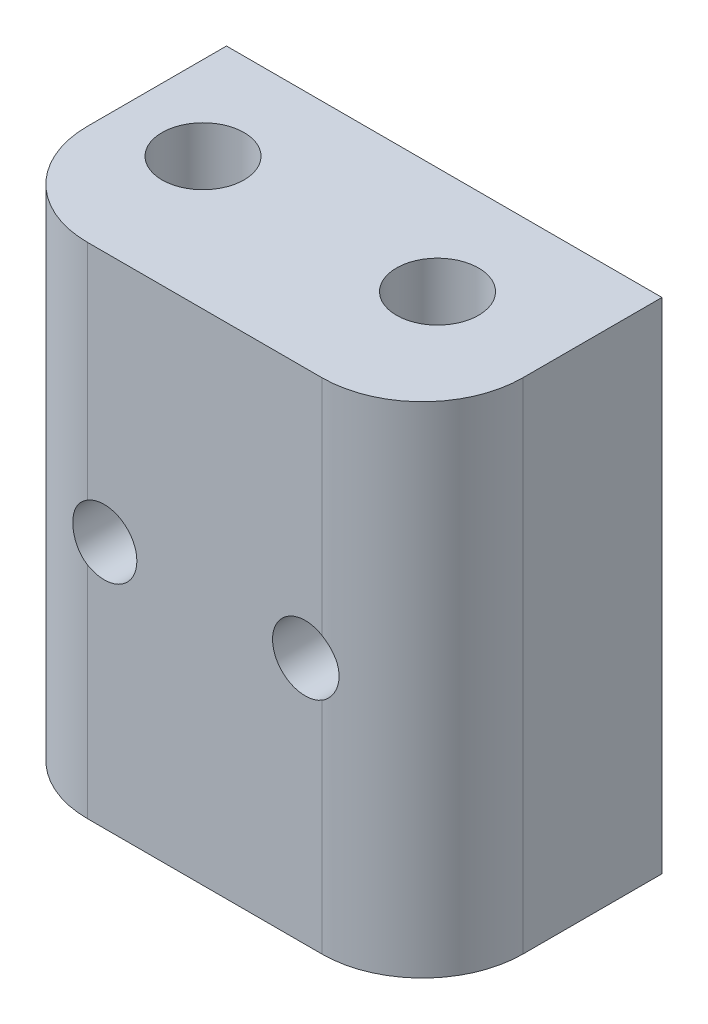
ISO-10303-21;
HEADER;
FILE_DESCRIPTION(('STEP AP214'),'2;1');
FILE_NAME('part.step','',(''),(''),'','','');
FILE_SCHEMA(('AUTOMOTIVE_DESIGN { 1 0 10303 214 1 1 1 1 }'));
ENDSEC;
DATA;
#1=APPLICATION_CONTEXT('core data for automotive mechanical design processes');
#2=APPLICATION_PROTOCOL_DEFINITION('international standard','automotive_design',2000,#1);
#3=PRODUCT_CONTEXT('',#1,'mechanical');
#4=PRODUCT('Part','Part','',(#3));
#5=PRODUCT_RELATED_PRODUCT_CATEGORY('part','',(#4));
#6=PRODUCT_DEFINITION_FORMATION('','',#4);
#7=PRODUCT_DEFINITION_CONTEXT('part definition',#1,'design');
#8=PRODUCT_DEFINITION('design','',#6,#7);
#9=PRODUCT_DEFINITION_SHAPE('','',#8);
#10=(LENGTH_UNIT() NAMED_UNIT(*) SI_UNIT(.MILLI.,.METRE.));
#11=(NAMED_UNIT(*) PLANE_ANGLE_UNIT() SI_UNIT($,.RADIAN.));
#12=(NAMED_UNIT(*) SI_UNIT($,.STERADIAN.) SOLID_ANGLE_UNIT());
#13=UNCERTAINTY_MEASURE_WITH_UNIT(LENGTH_MEASURE(1.E-05),#10,'distance_accuracy_value','');
#14=(GEOMETRIC_REPRESENTATION_CONTEXT(3) GLOBAL_UNCERTAINTY_ASSIGNED_CONTEXT((#13)) GLOBAL_UNIT_ASSIGNED_CONTEXT((#10,
#11,#12)) REPRESENTATION_CONTEXT('',''));
#15=CARTESIAN_POINT('',(0.,0.,0.));
#16=DIRECTION('',(0.,0.,1.));
#17=DIRECTION('',(1.,0.,0.));
#18=AXIS2_PLACEMENT_3D('',#15,#16,#17);
#19=CARTESIAN_POINT('',(13.1453049350976,13.6204306214154,14.3));
#20=DIRECTION('',(-1.,0.,0.));
#21=DIRECTION('',(0.,1.,0.));
#22=AXIS2_PLACEMENT_3D('',#19,#20,#21);
#23=PLANE('',#22);
#24=DIRECTION('',(0.,0.,-1.));
#25=VECTOR('',#24,1.);
#26=CARTESIAN_POINT('',(13.1453049350976,-16.1795693785846,14.3));
#27=LINE('',#26,#25);
#28=CARTESIAN_POINT('',(13.1453049350976,-16.1795693785846,8.3));
#29=VERTEX_POINT('',#28);
#30=CARTESIAN_POINT('',(13.1453049350976,-16.1795693785846,0.));
#31=VERTEX_POINT('',#30);
#32=EDGE_CURVE('E115',#29,#31,#27,.T.);
#33=ORIENTED_EDGE('',*,*,#32,.T.);
#34=DIRECTION('',(0.,-1.,0.));
#35=VECTOR('',#34,1.);
#36=CARTESIAN_POINT('',(13.1453049350976,13.6204306214154,0.));
#37=LINE('',#36,#35);
#38=CARTESIAN_POINT('',(13.1453049350976,13.6204306214154,0.));
#39=VERTEX_POINT('',#38);
#40=EDGE_CURVE('E214',#39,#31,#37,.T.);
#41=ORIENTED_EDGE('',*,*,#40,.F.);
#42=DIRECTION('',(0.,0.,-1.));
#43=VECTOR('',#42,1.);
#44=CARTESIAN_POINT('',(13.1453049350976,13.6204306214154,14.3));
#45=LINE('',#44,#43);
#46=CARTESIAN_POINT('',(13.1453049350976,13.6204306214154,8.3));
#47=VERTEX_POINT('',#46);
#48=EDGE_CURVE('E223',#47,#39,#45,.T.);
#49=ORIENTED_EDGE('',*,*,#48,.F.);
#50=DIRECTION('',(0.,-1.,0.));
#51=VECTOR('',#50,1.);
#52=CARTESIAN_POINT('',(13.1453049350976,13.6204306214154,8.3));
#53=LINE('',#52,#51);
#54=EDGE_CURVE('E250',#29,#47,#53,.F.);
#55=ORIENTED_EDGE('',*,*,#54,.F.);
#56=EDGE_LOOP('',(#33,#41,#49,#55));
#57=FACE_BOUND('',#56,.T.);
#58=ADVANCED_FACE('F32',(#57),#23,.F.);
#59=CARTESIAN_POINT('',(13.1453049350976,-16.1795693785846,14.3));
#60=DIRECTION('',(0.,1.,0.));
#61=DIRECTION('',(0.,0.,1.));
#62=AXIS2_PLACEMENT_3D('',#59,#60,#61);
#63=PLANE('',#62);
#64=CARTESIAN_POINT('',(6.14530493509756,-16.1795693785846,6.4));
#65=DIRECTION('',(0.,-1.,0.));
#66=DIRECTION('',(0.,0.,1.));
#67=AXIS2_PLACEMENT_3D('',#64,#65,#66);
#68=CIRCLE('',#67,2.45);
#69=CARTESIAN_POINT('',(6.14530493509756,-16.1795693785846,8.85));
#70=VERTEX_POINT('',#69);
#71=EDGE_CURVE('E166',#70,#70,#68,.T.);
#72=ORIENTED_EDGE('',*,*,#71,.F.);
#73=EDGE_LOOP('',(#72));
#74=FACE_BOUND('',#73,.T.);
#75=CARTESIAN_POINT('',(-7.85469506492416,-16.1795693785846,6.40000020034491));
#76=DIRECTION('',(0.,-1.,0.));
#77=DIRECTION('',(0.,0.,1.));
#78=AXIS2_PLACEMENT_3D('',#75,#76,#77);
#79=CIRCLE('',#78,2.45);
#80=CARTESIAN_POINT('',(-7.85469506492416,-16.1795693785846,8.85000020034491));
#81=VERTEX_POINT('',#80);
#82=EDGE_CURVE('E208',#81,#81,#79,.T.);
#83=ORIENTED_EDGE('',*,*,#82,.F.);
#84=EDGE_LOOP('',(#83));
#85=FACE_BOUND('',#84,.T.);
#86=DIRECTION('',(-1.,0.,0.));
#87=VECTOR('',#86,1.);
#88=CARTESIAN_POINT('',(13.1453049350976,-16.1795693785846,14.3));
#89=LINE('',#88,#87);
#90=CARTESIAN_POINT('',(7.14530493509755,-16.1795693785846,14.3));
#91=VERTEX_POINT('',#90);
#92=CARTESIAN_POINT('',(-6.85469506490244,-16.1795693785846,14.3));
#93=VERTEX_POINT('',#92);
#94=EDGE_CURVE('E218',#91,#93,#89,.T.);
#95=ORIENTED_EDGE('',*,*,#94,.T.);
#96=CARTESIAN_POINT('',(-6.85469506490245,-16.1795693785846,8.3));
#97=DIRECTION('',(0.,-1.,0.));
#98=DIRECTION('',(0.,0.,1.));
#99=AXIS2_PLACEMENT_3D('',#96,#97,#98);
#100=CIRCLE('',#99,6.);
#101=CARTESIAN_POINT('',(-12.8546950649024,-16.1795693785846,8.3));
#102=VERTEX_POINT('',#101);
#103=EDGE_CURVE('E246',#102,#93,#100,.F.);
#104=ORIENTED_EDGE('',*,*,#103,.F.);
#105=DIRECTION('',(0.,0.,-1.));
#106=VECTOR('',#105,1.);
#107=CARTESIAN_POINT('',(-12.8546950649024,-16.1795693785846,14.3));
#108=LINE('',#107,#106);
#109=CARTESIAN_POINT('',(-12.8546950649024,-16.1795693785846,0.));
#110=VERTEX_POINT('',#109);
#111=EDGE_CURVE('E238',#102,#110,#108,.T.);
#112=ORIENTED_EDGE('',*,*,#111,.T.);
#113=DIRECTION('',(-1.,0.,0.));
#114=VECTOR('',#113,1.);
#115=CARTESIAN_POINT('',(13.1453049350976,-16.1795693785846,0.));
#116=LINE('',#115,#114);
#117=EDGE_CURVE('E226',#31,#110,#116,.T.);
#118=ORIENTED_EDGE('',*,*,#117,.F.);
#119=ORIENTED_EDGE('',*,*,#32,.F.);
#120=CARTESIAN_POINT('',(7.14530493509755,-16.1795693785846,8.3));
#121=DIRECTION('',(0.,-1.,0.));
#122=DIRECTION('',(0.,0.,1.));
#123=AXIS2_PLACEMENT_3D('',#120,#121,#122);
#124=CIRCLE('',#123,6.);
#125=EDGE_CURVE('E248',#91,#29,#124,.F.);
#126=ORIENTED_EDGE('',*,*,#125,.F.);
#127=EDGE_LOOP('',(#95,#104,#112,#118,#119,#126));
#128=FACE_BOUND('',#127,.T.);
#129=ADVANCED_FACE('F176',(#74,#85,#128),#63,.F.);
#130=CARTESIAN_POINT('',(-12.8546950649024,13.6204306214154,14.3));
#131=DIRECTION('',(1.,0.,0.));
#132=DIRECTION('',(0.,-1.,0.));
#133=AXIS2_PLACEMENT_3D('',#130,#131,#132);
#134=PLANE('',#133);
#135=DIRECTION('',(0.,0.,-1.));
#136=VECTOR('',#135,1.);
#137=CARTESIAN_POINT('',(-12.8546950649024,13.6204306214154,14.3));
#138=LINE('',#137,#136);
#139=CARTESIAN_POINT('',(-12.8546950649024,13.6204306214154,8.3));
#140=VERTEX_POINT('',#139);
#141=CARTESIAN_POINT('',(-12.8546950649024,13.6204306214154,0.));
#142=VERTEX_POINT('',#141);
#143=EDGE_CURVE('E235',#140,#142,#138,.T.);
#144=ORIENTED_EDGE('',*,*,#143,.T.);
#145=DIRECTION('',(0.,1.,0.));
#146=VECTOR('',#145,1.);
#147=CARTESIAN_POINT('',(-12.8546950649024,13.6204306214154,0.));
#148=LINE('',#147,#146);
#149=EDGE_CURVE('E229',#110,#142,#148,.T.);
#150=ORIENTED_EDGE('',*,*,#149,.F.);
#151=ORIENTED_EDGE('',*,*,#111,.F.);
#152=DIRECTION('',(0.,1.,0.));
#153=VECTOR('',#152,1.);
#154=CARTESIAN_POINT('',(-12.8546950649024,-16.1795693785846,8.3));
#155=LINE('',#154,#153);
#156=EDGE_CURVE('E11',#140,#102,#155,.F.);
#157=ORIENTED_EDGE('',*,*,#156,.F.);
#158=EDGE_LOOP('',(#144,#150,#151,#157));
#159=FACE_BOUND('',#158,.T.);
#160=ADVANCED_FACE('F180',(#159),#134,.F.);
#161=CARTESIAN_POINT('',(13.1453049350976,13.6204306214154,14.3));
#162=DIRECTION('',(0.,-1.,0.));
#163=DIRECTION('',(0.,0.,-1.));
#164=AXIS2_PLACEMENT_3D('',#161,#162,#163);
#165=PLANE('',#164);
#166=CARTESIAN_POINT('',(6.14530493509756,13.6204306214154,6.4));
#167=DIRECTION('',(0.,-1.,0.));
#168=DIRECTION('',(0.,0.,1.));
#169=AXIS2_PLACEMENT_3D('',#166,#167,#168);
#170=CIRCLE('',#169,2.45);
#171=CARTESIAN_POINT('',(6.14530493509756,13.6204306214154,8.85));
#172=VERTEX_POINT('',#171);
#173=EDGE_CURVE('E153',#172,#172,#170,.T.);
#174=ORIENTED_EDGE('',*,*,#173,.T.);
#175=EDGE_LOOP('',(#174));
#176=FACE_BOUND('',#175,.T.);
#177=CARTESIAN_POINT('',(-7.85469506492416,13.6204306214154,6.40000020034491));
#178=DIRECTION('',(0.,-1.,0.));
#179=DIRECTION('',(0.,0.,1.));
#180=AXIS2_PLACEMENT_3D('',#177,#178,#179);
#181=CIRCLE('',#180,2.45);
#182=CARTESIAN_POINT('',(-7.85469506492416,13.6204306214154,8.85000020034491));
#183=VERTEX_POINT('',#182);
#184=EDGE_CURVE('E211',#183,#183,#181,.T.);
#185=ORIENTED_EDGE('',*,*,#184,.T.);
#186=EDGE_LOOP('',(#185));
#187=FACE_BOUND('',#186,.T.);
#188=ORIENTED_EDGE('',*,*,#48,.T.);
#189=DIRECTION('',(1.,0.,0.));
#190=VECTOR('',#189,1.);
#191=CARTESIAN_POINT('',(13.1453049350976,13.6204306214154,0.));
#192=LINE('',#191,#190);
#193=EDGE_CURVE('E221',#142,#39,#192,.T.);
#194=ORIENTED_EDGE('',*,*,#193,.F.);
#195=ORIENTED_EDGE('',*,*,#143,.F.);
#196=CARTESIAN_POINT('',(-6.85469506490245,13.6204306214154,8.3));
#197=DIRECTION('',(0.,1.,0.));
#198=DIRECTION('',(0.,0.,-1.));
#199=AXIS2_PLACEMENT_3D('',#196,#197,#198);
#200=CIRCLE('',#199,6.);
#201=CARTESIAN_POINT('',(-6.85469506490244,13.6204306214154,14.3));
#202=VERTEX_POINT('',#201);
#203=EDGE_CURVE('E253',#202,#140,#200,.F.);
#204=ORIENTED_EDGE('',*,*,#203,.F.);
#205=DIRECTION('',(1.,0.,0.));
#206=VECTOR('',#205,1.);
#207=CARTESIAN_POINT('',(13.1453049350976,13.6204306214154,14.3));
#208=LINE('',#207,#206);
#209=CARTESIAN_POINT('',(7.14530493509756,13.6204306214154,14.3));
#210=VERTEX_POINT('',#209);
#211=EDGE_CURVE('E113',#202,#210,#208,.T.);
#212=ORIENTED_EDGE('',*,*,#211,.T.);
#213=CARTESIAN_POINT('',(7.14530493509756,13.6204306214154,8.3));
#214=DIRECTION('',(0.,1.,0.));
#215=DIRECTION('',(0.,0.,-1.));
#216=AXIS2_PLACEMENT_3D('',#213,#214,#215);
#217=CIRCLE('',#216,6.);
#218=EDGE_CURVE('E46',#47,#210,#217,.F.);
#219=ORIENTED_EDGE('',*,*,#218,.F.);
#220=EDGE_LOOP('',(#188,#194,#195,#204,#212,#219));
#221=FACE_BOUND('',#220,.T.);
#222=ADVANCED_FACE('F184',(#176,#187,#221),#165,.F.);
#223=CARTESIAN_POINT('',(13.1453049350976,-16.1795693785846,14.3));
#224=DIRECTION('',(0.,0.,1.));
#225=DIRECTION('',(-1.,0.,0.));
#226=AXIS2_PLACEMENT_3D('',#223,#224,#225);
#227=PLANE('',#226);
#228=CARTESIAN_POINT('',(-5.85469506490245,-1.37956937858462,14.3));
#229=DIRECTION('',(0.,0.,-1.));
#230=DIRECTION('',(-1.,0.,0.));
#231=AXIS2_PLACEMENT_3D('',#228,#229,#230);
#232=CIRCLE('',#231,1.95);
#233=CARTESIAN_POINT('',(-6.85469506490245,0.294497525693705,14.3));
#234=VERTEX_POINT('',#233);
#235=CARTESIAN_POINT('',(-6.85469506490245,-3.05363628286294,14.3));
#236=VERTEX_POINT('',#235);
#237=EDGE_CURVE('E111',#234,#236,#232,.T.);
#238=ORIENTED_EDGE('',*,*,#237,.T.);
#239=DIRECTION('',(0.,1.,0.));
#240=VECTOR('',#239,1.);
#241=CARTESIAN_POINT('',(-6.85469506490245,13.6204306214154,14.3));
#242=LINE('',#241,#240);
#243=EDGE_CURVE('E105',#93,#236,#242,.T.);
#244=ORIENTED_EDGE('',*,*,#243,.F.);
#245=ORIENTED_EDGE('',*,*,#94,.F.);
#246=DIRECTION('',(0.,-1.,0.));
#247=VECTOR('',#246,1.);
#248=CARTESIAN_POINT('',(7.14530493509755,-16.1795693785846,14.3));
#249=LINE('',#248,#247);
#250=CARTESIAN_POINT('',(7.14530493509755,-3.05363628286294,14.3));
#251=VERTEX_POINT('',#250);
#252=EDGE_CURVE('E243',#251,#91,#249,.T.);
#253=ORIENTED_EDGE('',*,*,#252,.F.);
#254=CARTESIAN_POINT('',(6.14530493509755,-1.37956937858462,14.3));
#255=DIRECTION('',(0.,0.,-1.));
#256=DIRECTION('',(-1.,0.,0.));
#257=AXIS2_PLACEMENT_3D('',#254,#255,#256);
#258=CIRCLE('',#257,1.95);
#259=CARTESIAN_POINT('',(7.14530493509755,0.294497525693705,14.3));
#260=VERTEX_POINT('',#259);
#261=EDGE_CURVE('E107',#251,#260,#258,.T.);
#262=ORIENTED_EDGE('',*,*,#261,.T.);
#263=EDGE_CURVE('E244',#210,#260,#249,.T.);
#264=ORIENTED_EDGE('',*,*,#263,.F.);
#265=ORIENTED_EDGE('',*,*,#211,.F.);
#266=EDGE_CURVE('E102',#234,#202,#242,.T.);
#267=ORIENTED_EDGE('',*,*,#266,.F.);
#268=EDGE_LOOP('',(#238,#244,#245,#253,#262,#264,#265,#267));
#269=FACE_BOUND('',#268,.T.);
#270=ADVANCED_FACE('F110',(#269),#227,.T.);
#271=CARTESIAN_POINT('',(13.1453049350976,-16.1795693785846,0.));
#272=DIRECTION('',(0.,0.,1.));
#273=DIRECTION('',(-1.,0.,0.));
#274=AXIS2_PLACEMENT_3D('',#271,#272,#273);
#275=PLANE('',#274);
#276=CARTESIAN_POINT('',(-5.85469506490245,-1.37956937858462,0.));
#277=DIRECTION('',(0.,0.,-1.));
#278=DIRECTION('',(-1.,0.,0.));
#279=AXIS2_PLACEMENT_3D('',#276,#277,#278);
#280=CIRCLE('',#279,1.95);
#281=CARTESIAN_POINT('',(-7.80469506490245,-1.37956937858462,0.));
#282=VERTEX_POINT('',#281);
#283=EDGE_CURVE('E119',#282,#282,#280,.T.);
#284=ORIENTED_EDGE('',*,*,#283,.F.);
#285=EDGE_LOOP('',(#284));
#286=FACE_BOUND('',#285,.T.);
#287=CARTESIAN_POINT('',(6.14530493509755,-1.37956937858462,0.));
#288=DIRECTION('',(0.,0.,-1.));
#289=DIRECTION('',(-1.,0.,0.));
#290=AXIS2_PLACEMENT_3D('',#287,#288,#289);
#291=CIRCLE('',#290,1.95);
#292=CARTESIAN_POINT('',(4.19530493509755,-1.37956937858462,0.));
#293=VERTEX_POINT('',#292);
#294=EDGE_CURVE('E127',#293,#293,#291,.T.);
#295=ORIENTED_EDGE('',*,*,#294,.F.);
#296=EDGE_LOOP('',(#295));
#297=FACE_BOUND('',#296,.T.);
#298=ORIENTED_EDGE('',*,*,#40,.T.);
#299=ORIENTED_EDGE('',*,*,#117,.T.);
#300=ORIENTED_EDGE('',*,*,#149,.T.);
#301=ORIENTED_EDGE('',*,*,#193,.T.);
#302=EDGE_LOOP('',(#298,#299,#300,#301));
#303=FACE_BOUND('',#302,.T.);
#304=ADVANCED_FACE('F172',(#286,#297,#303),#275,.F.);
#305=CARTESIAN_POINT('',(7.14530493509755,-16.1795693785846,8.3));
#306=DIRECTION('',(0.,1.,0.));
#307=DIRECTION('',(1.,0.,0.));
#308=AXIS2_PLACEMENT_3D('',#305,#306,#307);
#309=CYLINDRICAL_SURFACE('',#308,6.);
#310=CARTESIAN_POINT('',(7.14530493509755,0.294497525693705,14.3));
#311=CARTESIAN_POINT('',(7.1921696200533,0.266503410643053,14.3000018072945));
#312=CARTESIAN_POINT('',(7.23783240159849,0.236554786161152,14.2994506606315));
#313=CARTESIAN_POINT('',(7.32646750732688,0.172955002499119,14.2974278403165));
#314=CARTESIAN_POINT('',(7.36944036393878,0.13930457969142,14.2959563494702));
#315=CARTESIAN_POINT('',(7.49375747901827,0.0332322869272666,14.2904462090898));
#316=CARTESIAN_POINT('',(7.57068769072364,-0.0444228691703343,14.2853104289395));
#317=CARTESIAN_POINT('',(7.71043908720387,-0.211356420944899,14.2737395438166));
#318=CARTESIAN_POINT('',(7.77326158036889,-0.300633737535304,14.2673045594413));
#319=CARTESIAN_POINT('',(7.88317621599532,-0.488428277006108,14.2547134776081));
#320=CARTESIAN_POINT('',(7.93026878522521,-0.586945249112567,14.248557372588));
#321=CARTESIAN_POINT('',(8.00774141398552,-0.791443063271864,14.237824436147));
#322=CARTESIAN_POINT('',(8.03796859196359,-0.897482663576686,14.2332621873414));
#323=CARTESIAN_POINT('',(8.080153387135,-1.11322369441396,14.2267630866548));
#324=CARTESIAN_POINT('',(8.09211071287886,-1.22292518333409,14.2248262766561));
#325=CARTESIAN_POINT('',(8.09735201427701,-1.44162115449943,14.223986230863));
#326=CARTESIAN_POINT('',(8.09083198083293,-1.55061085783406,14.2250511547799));
#327=CARTESIAN_POINT('',(8.05974312194822,-1.76590425634346,14.2299279398784));
#328=CARTESIAN_POINT('',(8.03517648909521,-1.87220827619492,14.2337394673579));
#329=CARTESIAN_POINT('',(7.96881384183982,-2.07890598764608,14.24331098493));
#330=CARTESIAN_POINT('',(7.92705981276687,-2.17931340519351,14.2490662208279));
#331=CARTESIAN_POINT('',(7.82746326327631,-2.37183687656617,14.2613056503569));
#332=CARTESIAN_POINT('',(7.76961042411703,-2.46394756220229,14.2677903099281));
#333=CARTESIAN_POINT('',(7.63855494668526,-2.63844745818186,14.2800576282276));
#334=CARTESIAN_POINT('',(7.56516269146031,-2.7206948567819,14.2858300746759));
#335=CARTESIAN_POINT('',(7.40561601259518,-2.87158618932355,14.2948781931312));
#336=CARTESIAN_POINT('',(7.31949255469582,-2.94026221100645,14.2981598079173));
#337=CARTESIAN_POINT('',(7.20108121598344,-3.01936277001372,14.2998038733818));
#338=CARTESIAN_POINT('',(7.17340013343576,-3.03686026905435,14.3000021848381));
#339=CARTESIAN_POINT('',(7.14530493509755,-3.05363628286294,14.3));
#340=B_SPLINE_CURVE_WITH_KNOTS('',3,(#310,#311,#312,#313,#314,#315,#316,#317,#318,#319,#320,
#321,#322,#323,#324,#325,#326,#327,#328,#329,#330,#331,#332,#333,#334,#335,#336,#337,#338,#339),
.UNSPECIFIED.,.F.,.F.,(4,2,2,2,2,2,2,2,2,2,2,2,2,2,4),(0.,0.163659727948247,0.327286958898937,
0.653894539156658,0.980471816372283,1.30704023250181,1.63652273621455,1.96601049593618,
2.29201647292962,2.61798284808707,2.94315763472363,3.26854132836156,3.59815140736063,
3.92697258881414,4.02517034280819),.UNSPECIFIED.);
#341=EDGE_CURVE('E60',#260,#251,#340,.T.);
#342=ORIENTED_EDGE('',*,*,#341,.T.);
#343=ORIENTED_EDGE('',*,*,#252,.T.);
#344=ORIENTED_EDGE('',*,*,#125,.T.);
#345=ORIENTED_EDGE('',*,*,#54,.T.);
#346=ORIENTED_EDGE('',*,*,#218,.T.);
#347=ORIENTED_EDGE('',*,*,#263,.T.);
#348=EDGE_LOOP('',(#342,#343,#344,#345,#346,#347));
#349=FACE_BOUND('',#348,.T.);
#350=ADVANCED_FACE('F168',(#349),#309,.T.);
#351=CARTESIAN_POINT('',(-6.85469506490245,-16.1795693785846,8.3));
#352=DIRECTION('',(0.,-1.,0.));
#353=DIRECTION('',(-1.,0.,0.));
#354=AXIS2_PLACEMENT_3D('',#351,#352,#353);
#355=CYLINDRICAL_SURFACE('',#354,6.);
#356=CARTESIAN_POINT('',(-6.85469506490244,-3.05363628286294,14.3));
#357=CARTESIAN_POINT('',(-6.90155974985819,-3.02564216781229,14.3000018072945));
#358=CARTESIAN_POINT('',(-6.94722253140338,-2.99569354333039,14.2994506606315));
#359=CARTESIAN_POINT('',(-7.03585763713177,-2.93209375966836,14.2974278403165));
#360=CARTESIAN_POINT('',(-7.07883049374366,-2.89844333686066,14.2959563494702));
#361=CARTESIAN_POINT('',(-7.20314760882316,-2.7923710440965,14.2904462090898));
#362=CARTESIAN_POINT('',(-7.28007782052853,-2.7147158879989,14.2853104289395));
#363=CARTESIAN_POINT('',(-7.41982921700876,-2.54778233622434,14.2737395438166));
#364=CARTESIAN_POINT('',(-7.48265171017378,-2.45850501963393,14.2673045594413));
#365=CARTESIAN_POINT('',(-7.59256634580021,-2.27071048016313,14.2547134776081));
#366=CARTESIAN_POINT('',(-7.6396589150301,-2.17219350805667,14.248557372588));
#367=CARTESIAN_POINT('',(-7.71713154379041,-1.96769569389738,14.237824436147));
#368=CARTESIAN_POINT('',(-7.74735872176848,-1.86165609359255,14.2332621873414));
#369=CARTESIAN_POINT('',(-7.78954351693989,-1.64591506275528,14.2267630866548));
#370=CARTESIAN_POINT('',(-7.80150084268375,-1.53621357383515,14.2248262766561));
#371=CARTESIAN_POINT('',(-7.8067421440819,-1.31751760266981,14.223986230863));
#372=CARTESIAN_POINT('',(-7.80022211063782,-1.20852789933518,14.2250511547799));
#373=CARTESIAN_POINT('',(-7.76913325175311,-0.993234500825779,14.2299279398784));
#374=CARTESIAN_POINT('',(-7.7445666189001,-0.886930480974322,14.2337394673579));
#375=CARTESIAN_POINT('',(-7.67820397164472,-0.680232769523159,14.24331098493));
#376=CARTESIAN_POINT('',(-7.63644994257177,-0.579825351975727,14.2490662208279));
#377=CARTESIAN_POINT('',(-7.5368533930812,-0.387301880603075,14.2613056503569));
#378=CARTESIAN_POINT('',(-7.47900055392192,-0.29519119496695,14.2677903099281));
#379=CARTESIAN_POINT('',(-7.34794507649016,-0.120691298987373,14.2800576282276));
#380=CARTESIAN_POINT('',(-7.27455282126521,-0.0384439003873347,14.2858300746759));
#381=CARTESIAN_POINT('',(-7.11500614240008,0.112447432154316,14.2948781931312));
#382=CARTESIAN_POINT('',(-7.02888268450072,0.181123453837215,14.2981598079173));
#383=CARTESIAN_POINT('',(-6.91047134578834,0.260224012844482,14.2998038733818));
#384=CARTESIAN_POINT('',(-6.88279026324065,0.277721511885115,14.3000021848381));
#385=CARTESIAN_POINT('',(-6.85469506490244,0.294497525693709,14.3));
#386=B_SPLINE_CURVE_WITH_KNOTS('',3,(#356,#357,#358,#359,#360,#361,#362,#363,#364,#365,#366,
#367,#368,#369,#370,#371,#372,#373,#374,#375,#376,#377,#378,#379,#380,#381,#382,#383,#384,#385),
.UNSPECIFIED.,.F.,.F.,(4,2,2,2,2,2,2,2,2,2,2,2,2,2,4),(0.,0.163659727948246,0.327286958898938,
0.653894539156657,0.980471816372282,1.3070402325018,1.63652273621455,1.96601049593618,
2.29201647292962,2.61798284808707,2.94315763472362,3.26854132836155,3.59815140736063,
3.92697258881414,4.0251703428082),.UNSPECIFIED.);
#387=EDGE_CURVE('E53',#236,#234,#386,.T.);
#388=ORIENTED_EDGE('',*,*,#387,.T.);
#389=ORIENTED_EDGE('',*,*,#266,.T.);
#390=ORIENTED_EDGE('',*,*,#203,.T.);
#391=ORIENTED_EDGE('',*,*,#156,.T.);
#392=ORIENTED_EDGE('',*,*,#103,.T.);
#393=ORIENTED_EDGE('',*,*,#243,.T.);
#394=EDGE_LOOP('',(#388,#389,#390,#391,#392,#393));
#395=FACE_BOUND('',#394,.T.);
#396=ADVANCED_FACE('F34',(#395),#355,.T.);
#397=CARTESIAN_POINT('',(-7.85469506492416,-16.1795693785846,6.40000020034491));
#398=DIRECTION('',(0.,1.,0.));
#399=DIRECTION('',(0.,0.,1.));
#400=AXIS2_PLACEMENT_3D('',#397,#398,#399);
#401=CYLINDRICAL_SURFACE('',#400,2.45);
#402=CARTESIAN_POINT('',(-7.80469506490245,-1.37956937858462,3.95051045756217));
#403=CARTESIAN_POINT('',(-7.80469016317818,-1.48827160937784,3.9505040545337));
#404=CARTESIAN_POINT('',(-7.79557577565852,-1.59705068663046,3.95064395620171));
#405=CARTESIAN_POINT('',(-7.75933675653578,-1.81167063267924,3.9517920867124));
#406=CARTESIAN_POINT('',(-7.73218849646207,-1.9175074566615,3.95280145526984));
#407=CARTESIAN_POINT('',(-7.6606185728202,-2.12320831558885,3.95743666479562));
#408=CARTESIAN_POINT('',(-7.61618668029895,-2.22306877308974,3.96106405627507));
#409=CARTESIAN_POINT('',(-7.51145078659348,-2.41372414619035,3.97359320635631));
#410=CARTESIAN_POINT('',(-7.45115346891539,-2.50452285699923,3.98249274597164));
#411=CARTESIAN_POINT('',(-7.31882171206404,-2.67181020940143,4.00840130357582));
#412=CARTESIAN_POINT('',(-7.24715452382028,-2.74862301767936,4.02518122041022));
#413=CARTESIAN_POINT('',(-7.09433531462095,-2.88837104767578,4.069625362282));
#414=CARTESIAN_POINT('',(-7.01319308959323,-2.95132041133728,4.09727841477162));
#415=CARTESIAN_POINT('',(-6.85372709610153,-3.05668677362242,4.16230629514479));
#416=CARTESIAN_POINT('',(-6.77583553282744,-3.10046341222371,4.19854690915801));
#417=CARTESIAN_POINT('',(-6.61987752532819,-3.17525251335298,4.28209029682505));
#418=CARTESIAN_POINT('',(-6.54181107977092,-3.20626487831901,4.32939315502726));
#419=CARTESIAN_POINT('',(-6.39129154606681,-3.25591748363389,4.43300474725705));
#420=CARTESIAN_POINT('',(-6.31874226285161,-3.27488177983245,4.4890220916181));
#421=CARTESIAN_POINT('',(-6.17944406809526,-3.30365491030616,4.60987439652999));
#422=CARTESIAN_POINT('',(-6.11269740244176,-3.31346021379995,4.67471274654291));
#423=CARTESIAN_POINT('',(-5.97874135168623,-3.32692903378007,4.82065935012479));
#424=CARTESIAN_POINT('',(-5.91255478931288,-3.32965176231864,4.90278803702953));
#425=CARTESIAN_POINT('',(-5.79128830385292,-3.32948305162056,5.0748741534468));
#426=CARTESIAN_POINT('',(-5.7362174023958,-3.32658707222726,5.16483785788415));
#427=CARTESIAN_POINT('',(-5.6282933758587,-3.31728578592294,5.36966768327731));
#428=CARTESIAN_POINT('',(-5.57809676024449,-3.31029347304888,5.48591110303434));
#429=CARTESIAN_POINT('',(-5.49618033951532,-3.29678388169471,5.72483563892085));
#430=CARTESIAN_POINT('',(-5.4644655879771,-3.29026673356677,5.84751850582983));
#431=CARTESIAN_POINT('',(-5.43034360709421,-3.2828716808949,6.03974738162183));
#432=CARTESIAN_POINT('',(-5.4211674923126,-3.28077695419724,6.10810862578674));
#433=CARTESIAN_POINT('',(-5.40860664447391,-3.27787173271757,6.24540800177586));
#434=CARTESIAN_POINT('',(-5.40522224991422,-3.27706131299715,6.31434616708166));
#435=CARTESIAN_POINT('',(-5.40428172325226,-3.27683763493227,6.45225286789412));
#436=CARTESIAN_POINT('',(-5.40672490329154,-3.27742421169315,6.52122139885584));
#437=CARTESIAN_POINT('',(-5.41741451051837,-3.27991558944641,6.65868088581347));
#438=CARTESIAN_POINT('',(-5.42566080496067,-3.2818203602853,6.72717185269738));
#439=CARTESIAN_POINT('',(-5.44761467344981,-3.28663754273111,6.86149705743158));
#440=CARTESIAN_POINT('',(-5.46118220558548,-3.28952388150389,6.92735511627972));
#441=CARTESIAN_POINT('',(-5.49367171188228,-3.29592838900101,7.05771296524497));
#442=CARTESIAN_POINT('',(-5.51259550422059,-3.29944677212377,7.12221228613824));
#443=CARTESIAN_POINT('',(-5.5772514523523,-3.31023426935761,7.3131235769223));
#444=CARTESIAN_POINT('',(-5.63086675507147,-3.31773530743173,7.4369402208653));
#445=CARTESIAN_POINT('',(-5.75961391041826,-3.32834290962288,7.67758663459924));
#446=CARTESIAN_POINT('',(-5.83529545990565,-3.33132333133345,7.79413171411331));
#447=CARTESIAN_POINT('',(-5.96249041055602,-3.3270470296585,7.95783477435574));
#448=CARTESIAN_POINT('',(-6.00714321578546,-3.32416719108803,8.01052779447369));
#449=CARTESIAN_POINT('',(-6.10053000849944,-3.31458115678265,8.11176629209426));
#450=CARTESIAN_POINT('',(-6.14926209437871,-3.30787673554001,8.16031368104492));
#451=CARTESIAN_POINT('',(-6.27147721148412,-3.28589912219455,8.27226027661643));
#452=CARTESIAN_POINT('',(-6.34673866934078,-3.26820598731515,8.3333004833112));
#453=CARTESIAN_POINT('',(-6.50139599912793,-3.22098114793517,8.4445406876806));
#454=CARTESIAN_POINT('',(-6.58078803979846,-3.19146024957962,8.49475051602372));
#455=CARTESIAN_POINT('',(-6.74035432301952,-3.11905215078386,8.58383291185946));
#456=CARTESIAN_POINT('',(-6.82053039791245,-3.0761141069289,8.62266124661462));
#457=CARTESIAN_POINT('',(-6.97716380852925,-2.97680455818933,8.68903713850839));
#458=CARTESIAN_POINT('',(-7.05362038552215,-2.92043032621131,8.71658240247428));
#459=CARTESIAN_POINT('',(-7.19467861767146,-2.79910909488927,8.76051437746291));
#460=CARTESIAN_POINT('',(-7.25971342417034,-2.73486335646201,8.77746315739191));
#461=CARTESIAN_POINT('',(-7.38068202701247,-2.59705751536698,8.80450863457686));
#462=CARTESIAN_POINT('',(-7.43661350067958,-2.52349504406153,8.81460358518493));
#463=CARTESIAN_POINT('',(-7.5409400068545,-2.36382230250252,8.83043834507541));
#464=CARTESIAN_POINT('',(-7.58861093738671,-2.27720764711539,8.83585321425349));
#465=CARTESIAN_POINT('',(-7.6703512742904,-2.09764706375873,8.8434006844442));
#466=CARTESIAN_POINT('',(-7.70441581303676,-2.00469888389462,8.84553211159789));
#467=CARTESIAN_POINT('',(-7.76031785669691,-1.80679953045864,8.84835735230784));
#468=CARTESIAN_POINT('',(-7.78090784984481,-1.70149204576758,8.84891736117953));
#469=CARTESIAN_POINT('',(-7.80456286971552,-1.4889230303542,8.84951584971942));
#470=CARTESIAN_POINT('',(-7.80762543849243,-1.38166122768518,8.84955425624213));
#471=CARTESIAN_POINT('',(-7.79600118774533,-1.16551406195427,8.84930460476452));
#472=CARTESIAN_POINT('',(-7.78088736005282,-1.05665137043388,8.84900870309062));
#473=CARTESIAN_POINT('',(-7.73261304158141,-0.842984599884023,8.84707454197378));
#474=CARTESIAN_POINT('',(-7.69944816060736,-0.73818151483583,8.84543595592768));
#475=CARTESIAN_POINT('',(-7.61610358476153,-0.535831512649243,8.83871138664881));
#476=CARTESIAN_POINT('',(-7.56594679200524,-0.438275043011217,8.83363003449083));
#477=CARTESIAN_POINT('',(-7.45028733522446,-0.253308928400414,8.81709554697236));
#478=CARTESIAN_POINT('',(-7.38479128949067,-0.165894931601254,8.80564515668252));
#479=CARTESIAN_POINT('',(-7.24438325947315,-0.0077298821657707,8.77380568425703));
#480=CARTESIAN_POINT('',(-7.17001858644592,0.0635887551118041,8.75383613608078));
#481=CARTESIAN_POINT('',(-7.01344655484112,0.192061515096244,8.70250971980026));
#482=CARTESIAN_POINT('',(-6.93124701195589,0.249229553122244,8.67116411403569));
#483=CARTESIAN_POINT('',(-6.77152893664733,0.343719278381834,8.59913522914317));
#484=CARTESIAN_POINT('',(-6.69428975380124,0.382395461905391,8.55959679832971));
#485=CARTESIAN_POINT('',(-6.54090138112294,0.447606526910862,8.46986448198991));
#486=CARTESIAN_POINT('',(-6.46475237306077,0.474139406004163,8.41966884112301));
#487=CARTESIAN_POINT('',(-6.31703245400055,0.516384433086188,8.30959704056693));
#488=CARTESIAN_POINT('',(-6.24544808414838,0.532129866584724,8.24975136932602));
#489=CARTESIAN_POINT('',(-6.10892271896318,0.555028289799112,8.12150165886356));
#490=CARTESIAN_POINT('',(-6.0439844839175,0.562177722547527,8.05309408970424));
#491=CARTESIAN_POINT('',(-5.9131841240646,0.570815451965627,7.89826033587974));
#492=CARTESIAN_POINT('',(-5.84863879231677,0.571296129737498,7.81066976134287));
#493=CARTESIAN_POINT('',(-5.7317519231221,0.567431088276451,7.6277703062974));
#494=CARTESIAN_POINT('',(-5.67942104645625,0.563081171820796,7.53245478046148));
#495=CARTESIAN_POINT('',(-5.57891408371036,0.551619863933241,7.31658349994153));
#496=CARTESIAN_POINT('',(-5.53354504922392,0.544135088105499,7.19473367279068));
#497=CARTESIAN_POINT('',(-5.46262292423095,0.530955433550126,6.94524318417809));
#498=CARTESIAN_POINT('',(-5.43707052112624,0.525260616916901,6.81760232199876));
#499=CARTESIAN_POINT('',(-5.4136609297428,0.519913760904359,6.62045786099571));
#500=CARTESIAN_POINT('',(-5.40843313333444,0.518679904748813,6.55179851741181));
#501=CARTESIAN_POINT('',(-5.40377141628335,0.517580926543868,6.41425426144202));
#502=CARTESIAN_POINT('',(-5.40433776573516,0.51771586830108,6.34536933869036));
#503=CARTESIAN_POINT('',(-5.41126729604069,0.519347193749857,6.20791724504455));
#504=CARTESIAN_POINT('',(-5.41762976429306,0.520843410080071,6.13935003613073));
#505=CARTESIAN_POINT('',(-5.43609160813689,0.524992336623807,6.00301754745663));
#506=CARTESIAN_POINT('',(-5.44819314505064,0.527645482504455,5.93525257968153));
#507=CARTESIAN_POINT('',(-5.49231523756606,0.536705128037746,5.73689361520664));
#508=CARTESIAN_POINT('',(-5.53232402820849,0.544277365184313,5.6080495054915));
#509=CARTESIAN_POINT('',(-5.6330201482398,0.558450518019482,5.35847158438107));
#510=CARTESIAN_POINT('',(-5.69372871530859,0.56505042611299,5.23774625565092));
#511=CARTESIAN_POINT('',(-5.79998116129818,0.569994654668781,5.06379356277921));
#512=CARTESIAN_POINT('',(-5.83854432970043,0.570792806313331,5.00629025158871));
#513=CARTESIAN_POINT('',(-5.92037686213272,0.569753894805331,4.89478014339275));
#514=CARTESIAN_POINT('',(-5.96364346841157,0.567918368228442,4.84077132679157));
#515=CARTESIAN_POINT('',(-6.05437827829295,0.560711713616706,4.73683873600163));
#516=CARTESIAN_POINT('',(-6.10183753673283,0.555347962656392,4.68690668215724));
#517=CARTESIAN_POINT('',(-6.20039201100726,0.540191142943871,4.59155190224531));
#518=CARTESIAN_POINT('',(-6.25148530597717,0.530400399745579,4.54612682386606));
#519=CARTESIAN_POINT('',(-6.37698970847029,0.500673820355629,4.44354027533944));
#520=CARTESIAN_POINT('',(-6.45274530698953,0.478273912981738,4.38867942869965));
#521=CARTESIAN_POINT('',(-6.60668840596233,0.421464526611615,4.28970345151686));
#522=CARTESIAN_POINT('',(-6.6848740860836,0.387063848675031,4.24558048623174));
#523=CARTESIAN_POINT('',(-6.84018585539093,0.305368505253931,4.16822547226445));
#524=CARTESIAN_POINT('',(-6.91730910742629,0.258044486884026,4.13501860043982));
#525=CARTESIAN_POINT('',(-7.06649284039248,0.150947258862639,4.07887828677454));
#526=CARTESIAN_POINT('',(-7.13855176915077,0.0911702545368505,4.05594798313741));
#527=CARTESIAN_POINT('',(-7.27225051743653,-0.0374136816143751,4.01925894025035));
#528=CARTESIAN_POINT('',(-7.33414255779365,-0.105886485118801,4.00523989704057));
#529=CARTESIAN_POINT('',(-7.44798841599019,-0.251531281968159,3.98329602118808));
#530=CARTESIAN_POINT('',(-7.49993707387379,-0.32870775910881,3.97537434626784));
#531=CARTESIAN_POINT('',(-7.59613275689051,-0.496404855717975,3.9631598490298));
#532=CARTESIAN_POINT('',(-7.63942086090868,-0.587499685632594,3.95921118554762));
#533=CARTESIAN_POINT('',(-7.71142063990183,-0.77527525025714,3.95392489673649));
#534=CARTESIAN_POINT('',(-7.74014315305518,-0.871951771818036,3.95258532787939));
#535=CARTESIAN_POINT('',(-7.77567862267666,-1.03743439105768,3.95123433832549));
#536=CARTESIAN_POINT('',(-7.78654667843209,-1.10539562718699,3.9509370131116));
#537=CARTESIAN_POINT('',(-7.80105655117956,-1.24208410533072,3.950577094508));
#538=CARTESIAN_POINT('',(-7.8046981654166,-1.31081136878346,3.95051450770439));
#539=CARTESIAN_POINT('',(-7.80469506490245,-1.37956937858462,3.95051045756217));
#540=B_SPLINE_CURVE_WITH_KNOTS('',3,(#402,#403,#404,#405,#406,#407,#408,#409,#410,#411,#412,
#413,#414,#415,#416,#417,#418,#419,#420,#421,#422,#423,#424,#425,#426,#427,#428,#429,#430,#431,
#432,#433,#434,#435,#436,#437,#438,#439,#440,#441,#442,#443,#444,#445,#446,#447,#448,#449,#450,
#451,#452,#453,#454,#455,#456,#457,#458,#459,#460,#461,#462,#463,#464,#465,#466,#467,#468,#469,
#470,#471,#472,#473,#474,#475,#476,#477,#478,#479,#480,#481,#482,#483,#484,#485,#486,#487,#488,
#489,#490,#491,#492,#493,#494,#495,#496,#497,#498,#499,#500,#501,#502,#503,#504,#505,#506,#507,
#508,#509,#510,#511,#512,#513,#514,#515,#516,#517,#518,#519,#520,#521,#522,#523,#524,#525,#526,
#527,#528,#529,#530,#531,#532,#533,#534,#535,#536,#537,#538,#539),.UNSPECIFIED.,.T.,.F.,(4,2,2,
2,2,2,2,2,2,2,2,2,2,2,2,2,2,2,2,2,2,2,2,2,2,2,2,2,2,2,2,2,2,2,2,2,2,2,2,2,2,2,2,2,2,2,2,2,2,2,2,
2,2,2,2,2,2,2,2,2,2,2,2,2,2,2,2,2,4),(0.,0.32586110540244,0.652150007248744,0.978632310819293,
1.30497729927761,1.62237208308082,1.93944158076249,2.22721756165835,2.51499574208942,
2.79466333979691,3.07443870460734,3.38983079073851,3.70547783332587,4.08438588217757,
4.46339748895556,4.67019483939543,4.87700427570417,5.0837893024447,5.2905695991673,
5.49223828882473,5.69397551698496,6.09747599405772,6.51204097703963,6.71912818332794,
6.92611938538598,7.2203097480015,7.51423194150963,7.80928172516877,8.10439144506523,
8.38210463998605,8.6598885815284,8.95568949153396,9.25159612840263,9.57202986926986,
9.89250854483403,10.2206654356912,10.5489021732445,10.8766982538498,11.2043531629128,
11.5174574557608,11.8302526159951,12.1138478553934,12.3974898418253,12.6802526385973,
12.9631324004934,13.2883566301672,13.6138636630012,14.0029370839628,14.3920240005489,
14.5984106991329,14.8048070184916,15.011177965967,15.2176266941388,15.6210734655908,
16.0249354195485,16.2324133915198,16.4397703631362,16.6466951496102,16.8535113619872,
17.1407116746883,17.4277018032468,17.715349275626,18.0030845285003,18.2819733907751,
18.5610065878112,18.8625418759363,19.1638524628253,19.3699653668639,19.5760840538088),.UNSPECIFIED.);
#541=CARTESIAN_POINT('',(-7.80469506490245,-1.37956937858462,3.95051045756217));
#542=VERTEX_POINT('',#541);
#543=EDGE_CURVE('E37',#542,#542,#540,.T.);
#544=ORIENTED_EDGE('',*,*,#543,.F.);
#545=EDGE_LOOP('',(#544));
#546=FACE_BOUND('',#545,.T.);
#547=ORIENTED_EDGE('',*,*,#82,.T.);
#548=EDGE_LOOP('',(#547));
#549=FACE_BOUND('',#548,.T.);
#550=ORIENTED_EDGE('',*,*,#184,.F.);
#551=EDGE_LOOP('',(#550));
#552=FACE_BOUND('',#551,.T.);
#553=ADVANCED_FACE('F193',(#546,#549,#552),#401,.F.);
#554=CARTESIAN_POINT('',(6.14530493509756,-16.1795693785846,6.4));
#555=DIRECTION('',(0.,1.,0.));
#556=DIRECTION('',(0.,0.,1.));
#557=AXIS2_PLACEMENT_3D('',#554,#555,#556);
#558=CYLINDRICAL_SURFACE('',#557,2.45);
#559=CARTESIAN_POINT('',(6.14530493509756,-3.32956937858462,8.85));
#560=CARTESIAN_POINT('',(6.05154198194233,-3.32956147264567,8.84999232795398));
#561=CARTESIAN_POINT('',(5.95766889634895,-3.32275228083281,8.84456341061618));
#562=CARTESIAN_POINT('',(5.77295573238411,-3.29597410427024,8.82333312395694));
#563=CARTESIAN_POINT('',(5.6821215399379,-3.27598097764231,8.80751272639362));
#564=CARTESIAN_POINT('',(5.50663824982531,-3.22427080671578,8.76699527708853));
#565=CARTESIAN_POINT('',(5.42195457080646,-3.19262657015003,8.74235337682736));
#566=CARTESIAN_POINT('',(5.25975178218965,-3.11917730987407,8.68597563873108));
#567=CARTESIAN_POINT('',(5.18223338367208,-3.0773712792014,8.65423909789193));
#568=CARTESIAN_POINT('',(5.00969409005102,-2.9690818722227,8.57366251227198));
#569=CARTESIAN_POINT('',(4.91788218867878,-2.8990631865984,8.52270196926845));
#570=CARTESIAN_POINT('',(4.74919387910903,-2.74574198290849,8.41578453506026));
#571=CARTESIAN_POINT('',(4.67236151271736,-2.66240156660482,8.35981359617222));
#572=CARTESIAN_POINT('',(4.5330676871552,-2.48245806897856,8.24697789840248));
#573=CARTESIAN_POINT('',(4.47084554195776,-2.38567064795893,8.19011263788059));
#574=CARTESIAN_POINT('',(4.36331860696766,-2.17984108038529,8.08306794125545));
#575=CARTESIAN_POINT('',(4.31795664198529,-2.07084201278046,8.03286628733728));
#576=CARTESIAN_POINT('',(4.26175248469197,-1.88905555241091,7.96708794925136));
#577=CARTESIAN_POINT('',(4.24441878911836,-1.82036204769094,7.94583468647213));
#578=CARTESIAN_POINT('',(4.21719037448231,-1.67955581116517,7.91173846416109));
#579=CARTESIAN_POINT('',(4.20727750916666,-1.60745188146832,7.89887499894113));
#580=CARTESIAN_POINT('',(4.1956021567082,-1.46080494076111,7.88366655286776));
#581=CARTESIAN_POINT('',(4.1939084480569,-1.38624658598387,7.88141033912612));
#582=CARTESIAN_POINT('',(4.19903798517965,-1.23791160191297,7.88813840093149));
#583=CARTESIAN_POINT('',(4.20586895769329,-1.16413574303011,7.89713287407681));
#584=CARTESIAN_POINT('',(4.22917564733382,-1.00783788932747,7.92687442586173));
#585=CARTESIAN_POINT('',(4.24704634232141,-0.925859485733868,7.94930340885645));
#586=CARTESIAN_POINT('',(4.29203774386225,-0.767420702651562,8.00284732646024));
#587=CARTESIAN_POINT('',(4.31918549013371,-0.690977254185442,8.03398760310608));
#588=CARTESIAN_POINT('',(4.39659564153191,-0.508649732200076,8.11728974215995));
#589=CARTESIAN_POINT('',(4.4517027806877,-0.406178254162608,8.17238103364433));
#590=CARTESIAN_POINT('',(4.57818080587799,-0.213412862598014,8.28516790651915));
#591=CARTESIAN_POINT('',(4.64957470071819,-0.123136467500885,8.34286707877559));
#592=CARTESIAN_POINT('',(4.81017565039375,0.0465788919493737,8.45666296846142));
#593=CARTESIAN_POINT('',(4.89977439290999,0.125700152820729,8.51268637237897));
#594=CARTESIAN_POINT('',(5.09507545229642,0.267856178333803,8.61622645034201));
#595=CARTESIAN_POINT('',(5.20073276141174,0.330934625237807,8.66376611661235));
#596=CARTESIAN_POINT('',(5.39361418527283,0.421905094431571,8.73339449554063));
#597=CARTESIAN_POINT('',(5.47731124280116,0.454696704510465,8.75886654344068));
#598=CARTESIAN_POINT('',(5.65044296871052,0.508766685721285,8.80115097258708));
#599=CARTESIAN_POINT('',(5.7398732309851,0.53005378245995,8.81796991632033));
#600=CARTESIAN_POINT('',(5.92262497316599,0.559895130046955,8.84160577321854));
#601=CARTESIAN_POINT('',(6.01596348536402,0.568385995162016,8.84837289262592));
#602=CARTESIAN_POINT('',(6.2030477891049,0.57181796699714,8.85110398179958));
#603=CARTESIAN_POINT('',(6.29679351906563,0.566761055845098,8.84706953190585));
#604=CARTESIAN_POINT('',(6.47440263932299,0.54438259286853,8.82931080442952));
#605=CARTESIAN_POINT('',(6.55847118028525,0.528035317898898,8.81635649829544));
#606=CARTESIAN_POINT('',(6.72225869385852,0.485048397326231,8.78256654563154));
#607=CARTESIAN_POINT('',(6.80197631194206,0.458405567138995,8.76172846056132));
#608=CARTESIAN_POINT('',(6.96072790393564,0.393960802914299,8.71191759215166));
#609=CARTESIAN_POINT('',(7.03936466288398,0.355535135500591,8.68249637288119));
#610=CARTESIAN_POINT('',(7.18906344420825,0.269829096328635,8.61804364824565));
#611=CARTESIAN_POINT('',(7.26012525653348,0.222548479125817,8.58301198737231));
#612=CARTESIAN_POINT('',(7.4070656270071,0.110581076180319,8.50208720884999));
#613=CARTESIAN_POINT('',(7.48128012739571,0.0442943178337322,8.45539660418374));
#614=CARTESIAN_POINT('',(7.61835543883499,-0.0979987636916998,8.35949749775125));
#615=CARTESIAN_POINT('',(7.68118039890645,-0.174034534282829,8.31028165026694));
#616=CARTESIAN_POINT('',(7.77243129309039,-0.303230605592736,8.23221564595397));
#617=CARTESIAN_POINT('',(7.80463673089235,-0.35354897047084,8.20300704697165));
#618=CARTESIAN_POINT('',(7.86460367422686,-0.457550846622363,8.14591612930193));
#619=CARTESIAN_POINT('',(7.89236276865188,-0.511236161875272,8.11803453592734));
#620=CARTESIAN_POINT('',(7.94306040770639,-0.6217726195945,8.06490777031142));
#621=CARTESIAN_POINT('',(7.9660189787112,-0.678609305649961,8.03965187572902));
#622=CARTESIAN_POINT('',(8.00685173821486,-0.795634490370894,7.99314181677022));
#623=CARTESIAN_POINT('',(8.02472988227277,-0.855820337515664,7.9718845434992));
#624=CARTESIAN_POINT('',(8.05594492137425,-0.983846915641234,7.93382173509987));
#625=CARTESIAN_POINT('',(8.06885940728459,-1.05192639385189,7.91744983604279));
#626=CARTESIAN_POINT('',(8.08737193237339,-1.19052024872135,7.89369124356061));
#627=CARTESIAN_POINT('',(8.09298730651508,-1.26102844660417,7.8862832642552));
#628=CARTESIAN_POINT('',(8.09645978001701,-1.40288216583168,7.88172421388623));
#629=CARTESIAN_POINT('',(8.09428496335985,-1.47422993538117,7.88461533745972));
#630=CARTESIAN_POINT('',(8.08231065851655,-1.61523411570966,7.90019867786848));
#631=CARTESIAN_POINT('',(8.07249831546018,-1.68488747055958,7.91290741865621));
#632=CARTESIAN_POINT('',(8.04183198512819,-1.84212783314964,7.95127249982937));
#633=CARTESIAN_POINT('',(8.01848672733023,-1.9285222666115,7.97973285071178));
#634=CARTESIAN_POINT('',(7.96159300807958,-2.09466251649644,8.04483101321943));
#635=CARTESIAN_POINT('',(7.92801267402068,-2.17438655816265,8.08149427294108));
#636=CARTESIAN_POINT('',(7.83555517797152,-2.3595424004291,8.17524945896838));
#637=CARTESIAN_POINT('',(7.77198651098591,-2.46157617317998,8.23442069610177));
#638=CARTESIAN_POINT('',(7.62754222116402,-2.65226501101673,8.35300897221397));
#639=CARTESIAN_POINT('',(7.54667030438571,-2.74092293405651,8.41242595588984));
#640=CARTESIAN_POINT('',(7.3818548810078,-2.89080387273938,8.51694079741145));
#641=CARTESIAN_POINT('',(7.30035087803314,-2.95414921017858,8.56282762081804));
#642=CARTESIAN_POINT('',(7.12569793786185,-3.06840809417558,8.64737652502778));
#643=CARTESIAN_POINT('',(7.03256573691586,-3.11933920338623,8.68604879400248));
#644=CARTESIAN_POINT('',(6.85356582864996,-3.19854544819654,8.74694648740859));
#645=CARTESIAN_POINT('',(6.76934985787337,-3.2292385964632,8.77087353608012));
#646=CARTESIAN_POINT('',(6.59566888077437,-3.27898615125274,8.80988433107729));
#647=CARTESIAN_POINT('',(6.50621587145319,-3.29806609943126,8.82498748140959));
#648=CARTESIAN_POINT('',(6.37084335064596,-3.31700781292856,8.84001146865624));
#649=CARTESIAN_POINT('',(6.3259588738783,-3.32170830083232,8.84374708867989));
#650=CARTESIAN_POINT('',(6.23582651838809,-3.32799132037236,8.84874346694174));
#651=CARTESIAN_POINT('',(6.19057856521488,-3.32957319598311,8.85000370446282));
#652=CARTESIAN_POINT('',(6.14530493509756,-3.32956937858462,8.85));
#653=B_SPLINE_CURVE_WITH_KNOTS('',3,(#559,#560,#561,#562,#563,#564,#565,#566,#567,#568,#569,
#570,#571,#572,#573,#574,#575,#576,#577,#578,#579,#580,#581,#582,#583,#584,#585,#586,#587,#588,
#589,#590,#591,#592,#593,#594,#595,#596,#597,#598,#599,#600,#601,#602,#603,#604,#605,#606,#607,
#608,#609,#610,#611,#612,#613,#614,#615,#616,#617,#618,#619,#620,#621,#622,#623,#624,#625,#626,
#627,#628,#629,#630,#631,#632,#633,#634,#635,#636,#637,#638,#639,#640,#641,#642,#643,#644,#645,
#646,#647,#648,#649,#650,#651,#652),.UNSPECIFIED.,.T.,.F.,(4,2,2,2,2,2,2,2,2,2,2,2,2,2,2,2,2,2,
2,2,2,2,2,2,2,2,2,2,2,2,2,2,2,2,2,2,2,2,2,2,2,2,2,2,2,2,4),(0.,0.281093531724269,
0.562703225036777,0.84258220803475,1.12248893638978,1.49912451426477,1.87685128188588,
2.26039008637209,2.64261612742766,2.86378821651169,3.08441768792538,3.30689025602953,
3.52956461898893,3.78866635446793,4.04852982500421,4.4327217398702,4.81745981317816,
5.21157345902989,5.6046022158046,5.88377284942142,6.1627314476506,6.44306736840853,
6.72336227643558,6.98207625808674,7.24087032835684,7.5168563417269,7.79285000610555,
8.12145513086855,8.45107729984632,8.65037238412279,8.84977517642949,9.04832874799121,
9.24672730190853,9.4594874001602,9.67174127680535,9.88486573964655,10.0983496941805,
10.3785036234846,10.6595390391516,11.0595026940936,11.4593807693141,11.7969876327719,
12.1341140683192,12.4113099853322,12.68789402362,12.823592057436,12.959318633396),.UNSPECIFIED.);
#654=CARTESIAN_POINT('',(6.14530493509756,-3.32956937858462,8.85));
#655=VERTEX_POINT('',#654);
#656=EDGE_CURVE('E147',#655,#655,#653,.T.);
#657=ORIENTED_EDGE('',*,*,#656,.F.);
#658=EDGE_LOOP('',(#657));
#659=FACE_BOUND('',#658,.T.);
#660=CARTESIAN_POINT('',(4.19530493509755,-1.37956937858462,4.91676030258087));
#661=CARTESIAN_POINT('',(4.19530030879389,-1.45338975672788,4.91677111265765));
#662=CARTESIAN_POINT('',(4.19953282612807,-1.527190009679,4.91115464078853));
#663=CARTESIAN_POINT('',(4.21603594593352,-1.6724672686693,4.8898361143736));
#664=CARTESIAN_POINT('',(4.22832495258967,-1.743938561096,4.87411096925253));
#665=CARTESIAN_POINT('',(4.26553860520249,-1.90701317444972,4.82834465952641));
#666=CARTESIAN_POINT('',(4.29335842041753,-1.99706517780889,4.79523734438257));
#667=CARTESIAN_POINT('',(4.36009929085138,-2.16959778325543,4.72130042540931));
#668=CARTESIAN_POINT('',(4.39905282753388,-2.25205528462051,4.68044834621342));
#669=CARTESIAN_POINT('',(4.50257346395907,-2.437318871887,4.58044898956443));
#670=CARTESIAN_POINT('',(4.57132901599649,-2.53704976307594,4.51992939566337));
#671=CARTESIAN_POINT('',(4.7263968693815,-2.72261804016016,4.40029671815655));
#672=CARTESIAN_POINT('',(4.81269472694286,-2.80846675246373,4.34118252183024));
#673=CARTESIAN_POINT('',(4.98392536859108,-2.94910472927136,4.24094207840678));
#674=CARTESIAN_POINT('',(5.06582155003247,-3.00668455583402,4.19855936286143));
#675=CARTESIAN_POINT('',(5.24012679716336,-3.10970288698968,4.12136042084042));
#676=CARTESIAN_POINT('',(5.33251922662126,-3.15516023282777,4.08653246835921));
#677=CARTESIAN_POINT('',(5.51071024203487,-3.22549322043223,4.03208397863539));
#678=CARTESIAN_POINT('',(5.59519067878103,-3.25250029882117,4.01092045633413));
#679=CARTESIAN_POINT('',(5.76872361275018,-3.29494089106875,3.97750648239378));
#680=CARTESIAN_POINT('',(5.85777360941737,-3.31038066412693,3.96525121050679));
#681=CARTESIAN_POINT('',(6.03828645905418,-3.32874913981543,3.95065926128236));
#682=CARTESIAN_POINT('',(6.12975642243169,-3.33163557148568,3.94835609591489));
#683=CARTESIAN_POINT('',(6.3118806589759,-3.32457782977725,3.95397192836717));
#684=CARTESIAN_POINT('',(6.40253488661884,-3.31463294473853,3.96189149316759));
#685=CARTESIAN_POINT('',(6.57551401718999,-3.28344436862591,3.98656764204067));
#686=CARTESIAN_POINT('',(6.65802567443815,-3.26282795144315,4.00283322480911));
#687=CARTESIAN_POINT('',(6.81804422101547,-3.21177639324767,4.04272837172997));
#688=CARTESIAN_POINT('',(6.89554985212907,-3.18133879521426,4.06635977858218));
#689=CARTESIAN_POINT('',(7.05164090857752,-3.10849459214749,4.12215462449167));
#690=CARTESIAN_POINT('',(7.12959581407499,-3.0652107815004,4.15492501411717));
#691=CARTESIAN_POINT('',(7.27728700621175,-2.96980782899599,4.2256418984807));
#692=CARTESIAN_POINT('',(7.34701846857968,-2.91768354417022,4.26359140365776));
#693=CARTESIAN_POINT('',(7.49140931808472,-2.79424043189636,4.35085382946088));
#694=CARTESIAN_POINT('',(7.56413358731482,-2.72117863273424,4.40089877400572));
#695=CARTESIAN_POINT('',(7.69701656341345,-2.5649920753472,4.50219342233435));
#696=CARTESIAN_POINT('',(7.75716046506934,-2.48185564040458,4.55344446751747));
#697=CARTESIAN_POINT('',(7.85861775563055,-2.31526647970364,4.64748374948328));
#698=CARTESIAN_POINT('',(7.90125877821141,-2.23280356093001,4.69059015948567));
#699=CARTESIAN_POINT('',(7.97519078460632,-2.05987809851455,4.76998567696496));
#700=CARTESIAN_POINT('',(8.00650662928511,-1.96943362596673,4.80628963156054));
#701=CARTESIAN_POINT('',(8.04878872027627,-1.80851089542348,4.85726968016451));
#702=CARTESIAN_POINT('',(8.06302854862818,-1.73994024858407,4.87516600410849));
#703=CARTESIAN_POINT('',(8.08408917370708,-1.60001454893118,4.90202947903241));
#704=CARTESIAN_POINT('',(8.09092599993109,-1.52866586001995,4.91101591873994));
#705=CARTESIAN_POINT('',(8.09663370483955,-1.38468719153652,4.9184989251862));
#706=CARTESIAN_POINT('',(8.09546232500581,-1.31205243533032,4.91693984470832));
#707=CARTESIAN_POINT('',(8.08516943743281,-1.1682858040346,4.90350823433694));
#708=CARTESIAN_POINT('',(8.07603641507499,-1.09715625855087,4.89162076697594));
#709=CARTESIAN_POINT('',(8.0471684018179,-0.939783763850318,4.8553088437098));
#710=CARTESIAN_POINT('',(8.02526430348492,-0.854534570829131,4.82839585248932));
#711=CARTESIAN_POINT('',(7.97151902149367,-0.690405462070456,4.76625263593735));
#712=CARTESIAN_POINT('',(7.9396485573658,-0.611545187397415,4.73099797864001));
#713=CARTESIAN_POINT('',(7.85102156593049,-0.42684967937946,4.63970337145595));
#714=CARTESIAN_POINT('',(7.78948830174818,-0.324452899442876,4.58135288390658));
#715=CARTESIAN_POINT('',(7.64926750392095,-0.132691689894144,4.46375999606526));
#716=CARTESIAN_POINT('',(7.57056087598525,-0.0433419527718238,4.40451667187388));
#717=CARTESIAN_POINT('',(7.39523229265189,0.122053828959547,4.29019451792335));
#718=CARTESIAN_POINT('',(7.29840537380557,0.197926095899521,4.23517465148821));
#719=CARTESIAN_POINT('',(7.08837439756894,0.331714926198816,4.13582180729459));
#720=CARTESIAN_POINT('',(6.97522575487167,0.389690240901231,4.09145397047885));
#721=CARTESIAN_POINT('',(6.77419811102594,0.468293919453836,4.03056824516938));
#722=CARTESIAN_POINT('',(6.68997355276352,0.494936812232637,4.00968387917688));
#723=CARTESIAN_POINT('',(6.51704400196362,0.536728697371928,3.97677303961792));
#724=CARTESIAN_POINT('',(6.42834245771346,0.551886396061113,3.96473985663235));
#725=CARTESIAN_POINT('',(6.24859223666173,0.569793473469599,3.95051314758055));
#726=CARTESIAN_POINT('',(6.15753666647763,0.572500928923925,3.94835286633825));
#727=CARTESIAN_POINT('',(5.97625978825581,0.565206417217941,3.95415700575231));
#728=CARTESIAN_POINT('',(5.88603856927353,0.555203108776758,3.9621224949127));
#729=CARTESIAN_POINT('',(5.71349973194461,0.5239439642238,3.98685310744725));
#730=CARTESIAN_POINT('',(5.63101118566756,0.503259860052904,4.0031707898401));
#731=CARTESIAN_POINT('',(5.47104885024869,0.452079716960235,4.04316227868085));
#732=CARTESIAN_POINT('',(5.39357634833386,0.421581171331381,4.06683796438387));
#733=CARTESIAN_POINT('',(5.23752574094911,0.348600026138617,4.12272885485072));
#734=CARTESIAN_POINT('',(5.15958198960685,0.305236470689171,4.15555317895331));
#735=CARTESIAN_POINT('',(5.01192302382549,0.209673430838532,4.22637092540437));
#736=CARTESIAN_POINT('',(4.94221279077359,0.157468643386715,4.26436744738366));
#737=CARTESIAN_POINT('',(4.7978617511669,0.0338310709439084,4.35173305735899));
#738=CARTESIAN_POINT('',(4.72516101333026,-0.0393475541685594,4.40183291544112));
#739=CARTESIAN_POINT('',(4.5923545752219,-0.195764573170597,4.50320747068443));
#740=CARTESIAN_POINT('',(4.53226186264294,-0.279013202526996,4.5544833195371));
#741=CARTESIAN_POINT('',(4.4310554934778,-0.445610366913063,4.64840816197897));
#742=CARTESIAN_POINT('',(4.38858260925014,-0.527944895275796,4.69138628819201));
#743=CARTESIAN_POINT('',(4.31491670780397,-0.700626014807368,4.77055470950444));
#744=CARTESIAN_POINT('',(4.28370844959183,-0.790961572826212,4.80675414397335));
#745=CARTESIAN_POINT('',(4.2384623508506,-0.963618720942448,4.86132929131131));
#746=CARTESIAN_POINT('',(4.22242827198176,-1.04476207791848,4.88167127356736));
#747=CARTESIAN_POINT('',(4.20087159757244,-1.21047810379855,4.90935662209903));
#748=CARTESIAN_POINT('',(4.19531023272347,-1.29503693603816,4.9167479238554));
#749=CARTESIAN_POINT('',(4.19530493509755,-1.37956937858462,4.91676030258087));
#750=B_SPLINE_CURVE_WITH_KNOTS('',3,(#660,#661,#662,#663,#664,#665,#666,#667,#668,#669,#670,
#671,#672,#673,#674,#675,#676,#677,#678,#679,#680,#681,#682,#683,#684,#685,#686,#687,#688,#689,
#690,#691,#692,#693,#694,#695,#696,#697,#698,#699,#700,#701,#702,#703,#704,#705,#706,#707,#708,
#709,#710,#711,#712,#713,#714,#715,#716,#717,#718,#719,#720,#721,#722,#723,#724,#725,#726,#727,
#728,#729,#730,#731,#732,#733,#734,#735,#736,#737,#738,#739,#740,#741,#742,#743,#744,#745,#746,
#747,#748,#749),.UNSPECIFIED.,.T.,.F.,(4,2,2,2,2,2,2,2,2,2,2,2,2,2,2,2,2,2,2,2,2,2,2,2,2,2,2,2,
2,2,2,2,2,2,2,2,2,2,2,2,2,2,2,2,4),(0.,0.221127035938803,0.442760981311087,0.740782603972969,
1.03968270669128,1.4439625829666,1.8479109263933,2.17282315793731,2.49722741517779,
2.76961532907668,3.04185574413168,3.31501217006207,3.58818374664854,3.84686612912579,
4.10561327788868,4.38957004796326,4.67369258082223,5.01623854890498,5.35918540207674,
5.66535871237596,5.9708557762528,6.18690563542038,6.40248674708136,6.61920633393724,
6.83623987500469,7.11082318554291,7.38622090369299,7.78305339483789,8.1803293751566,
8.58240523495205,8.9831467857391,9.25434955762488,9.52534653854027,9.79725537304975,
10.0691929026409,10.3278868722208,10.5866469673544,10.8707408624153,11.1550057670105,
11.4977998795098,11.8409453935798,12.1464249527737,12.4514896362182,12.7056471227938,
12.9588618709584),.UNSPECIFIED.);
#751=CARTESIAN_POINT('',(4.19530493509755,-1.37956937858462,4.91676030258087));
#752=VERTEX_POINT('',#751);
#753=EDGE_CURVE('E143',#752,#752,#750,.T.);
#754=ORIENTED_EDGE('',*,*,#753,.F.);
#755=EDGE_LOOP('',(#754));
#756=FACE_BOUND('',#755,.T.);
#757=ORIENTED_EDGE('',*,*,#71,.T.);
#758=EDGE_LOOP('',(#757));
#759=FACE_BOUND('',#758,.T.);
#760=ORIENTED_EDGE('',*,*,#173,.F.);
#761=EDGE_LOOP('',(#760));
#762=FACE_BOUND('',#761,.T.);
#763=ADVANCED_FACE('F138',(#659,#756,#759,#762),#558,.F.);
#764=CARTESIAN_POINT('',(6.14530493509755,-1.37956937858462,0.));
#765=DIRECTION('',(0.,0.,1.));
#766=DIRECTION('',(-1.,0.,0.));
#767=AXIS2_PLACEMENT_3D('',#764,#765,#766);
#768=CYLINDRICAL_SURFACE('',#767,1.95);
#769=ORIENTED_EDGE('',*,*,#294,.T.);
#770=EDGE_LOOP('',(#769));
#771=FACE_BOUND('',#770,.T.);
#772=ORIENTED_EDGE('',*,*,#753,.T.);
#773=EDGE_LOOP('',(#772));
#774=FACE_BOUND('',#773,.T.);
#775=ADVANCED_FACE('F137',(#771,#774),#768,.F.);
#776=ORIENTED_EDGE('',*,*,#341,.F.);
#777=ORIENTED_EDGE('',*,*,#261,.F.);
#778=EDGE_LOOP('',(#776,#777));
#779=FACE_BOUND('',#778,.T.);
#780=ORIENTED_EDGE('',*,*,#656,.T.);
#781=EDGE_LOOP('',(#780));
#782=FACE_BOUND('',#781,.T.);
#783=ADVANCED_FACE('F132',(#779,#782),#768,.F.);
#784=CARTESIAN_POINT('',(-5.85469506490245,-1.37956937858462,0.));
#785=DIRECTION('',(0.,0.,1.));
#786=DIRECTION('',(-1.,0.,0.));
#787=AXIS2_PLACEMENT_3D('',#784,#785,#786);
#788=CYLINDRICAL_SURFACE('',#787,1.95);
#789=ORIENTED_EDGE('',*,*,#387,.F.);
#790=ORIENTED_EDGE('',*,*,#237,.F.);
#791=EDGE_LOOP('',(#789,#790));
#792=FACE_BOUND('',#791,.T.);
#793=ORIENTED_EDGE('',*,*,#283,.T.);
#794=EDGE_LOOP('',(#793));
#795=FACE_BOUND('',#794,.T.);
#796=ORIENTED_EDGE('',*,*,#543,.T.);
#797=EDGE_LOOP('',(#796));
#798=FACE_BOUND('',#797,.T.);
#799=ADVANCED_FACE('F117',(#792,#795,#798),#788,.F.);
#800=CLOSED_SHELL('',(#58,#129,#160,#222,#270,#304,#350,#396,#553,#763,#775,#783,#799));
#801=MANIFOLD_SOLID_BREP('B2',#800);
#802=ADVANCED_BREP_SHAPE_REPRESENTATION('',(#18,#801),#14);
#803=SHAPE_DEFINITION_REPRESENTATION(#9,#802);
ENDSEC;
END-ISO-10303-21;
